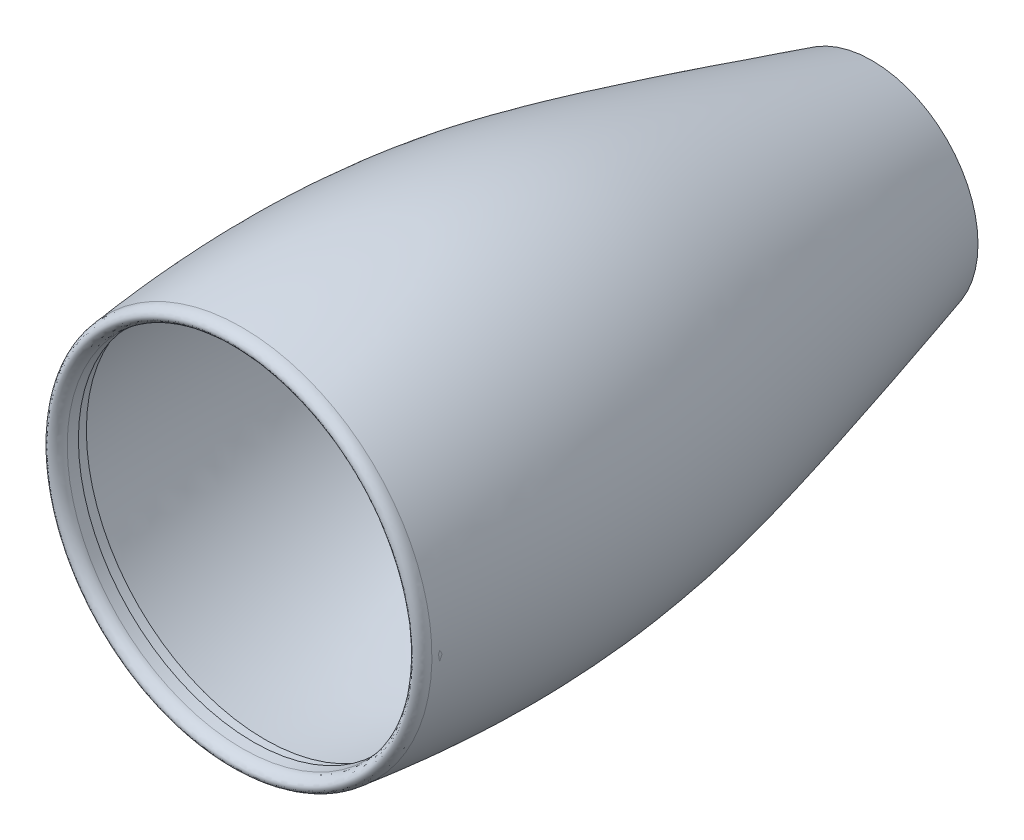
ISO-10303-21;
HEADER;
FILE_DESCRIPTION(('STEP AP214'),'2;1');
FILE_NAME('part.step','',(''),(''),'','','');
FILE_SCHEMA(('AUTOMOTIVE_DESIGN { 1 0 10303 214 1 1 1 1 }'));
ENDSEC;
DATA;
#1=APPLICATION_CONTEXT('core data for automotive mechanical design processes');
#2=APPLICATION_PROTOCOL_DEFINITION('international standard','automotive_design',2000,#1);
#3=PRODUCT_CONTEXT('',#1,'mechanical');
#4=PRODUCT('Part','Part','',(#3));
#5=PRODUCT_RELATED_PRODUCT_CATEGORY('part','',(#4));
#6=PRODUCT_DEFINITION_FORMATION('','',#4);
#7=PRODUCT_DEFINITION_CONTEXT('part definition',#1,'design');
#8=PRODUCT_DEFINITION('design','',#6,#7);
#9=PRODUCT_DEFINITION_SHAPE('','',#8);
#10=(LENGTH_UNIT() NAMED_UNIT(*) SI_UNIT(.MILLI.,.METRE.));
#11=(NAMED_UNIT(*) PLANE_ANGLE_UNIT() SI_UNIT($,.RADIAN.));
#12=(NAMED_UNIT(*) SI_UNIT($,.STERADIAN.) SOLID_ANGLE_UNIT());
#13=UNCERTAINTY_MEASURE_WITH_UNIT(LENGTH_MEASURE(1.E-05),#10,'distance_accuracy_value','');
#14=(GEOMETRIC_REPRESENTATION_CONTEXT(3) GLOBAL_UNCERTAINTY_ASSIGNED_CONTEXT((#13)) GLOBAL_UNIT_ASSIGNED_CONTEXT((#10,
#11,#12)) REPRESENTATION_CONTEXT('',''));
#15=CARTESIAN_POINT('',(0.,0.,0.));
#16=DIRECTION('',(0.,0.,1.));
#17=DIRECTION('',(1.,0.,0.));
#18=AXIS2_PLACEMENT_3D('',#15,#16,#17);
#19=CARTESIAN_POINT('',(0.,0.,-403.00562877427));
#20=DIRECTION('',(0.,0.,1.));
#21=DIRECTION('',(1.,0.,0.));
#22=AXIS2_PLACEMENT_3D('',#19,#20,#21);
#23=PLANE('',#22);
#24=CARTESIAN_POINT('',(0.,0.,-403.00562877427));
#25=DIRECTION('',(0.,0.,-1.));
#26=DIRECTION('',(-1.,0.,0.));
#27=AXIS2_PLACEMENT_3D('',#24,#25,#26);
#28=CIRCLE('',#27,3400.75582565315);
#29=CARTESIAN_POINT('',(-3400.75582565315,0.,-403.00562877427));
#30=VERTEX_POINT('',#29);
#31=EDGE_CURVE('E51',#30,#30,#28,.T.);
#32=ORIENTED_EDGE('',*,*,#31,.F.);
#33=EDGE_LOOP('',(#32));
#34=FACE_BOUND('',#33,.T.);
#35=CARTESIAN_POINT('',(0.,0.,-403.00562877427));
#36=DIRECTION('',(0.,0.,-1.));
#37=DIRECTION('',(-1.,0.,0.));
#38=AXIS2_PLACEMENT_3D('',#35,#36,#37);
#39=CIRCLE('',#38,3420.75582565315);
#40=CARTESIAN_POINT('',(-3420.75582565315,0.,-403.00562877427));
#41=VERTEX_POINT('',#40);
#42=EDGE_CURVE('E128',#41,#41,#39,.T.);
#43=ORIENTED_EDGE('',*,*,#42,.T.);
#44=EDGE_LOOP('',(#43));
#45=FACE_BOUND('',#44,.T.);
#46=ADVANCED_FACE('F33',(#34,#45),#23,.F.);
#47=CARTESIAN_POINT('',(0.,0.,-11968.002568167));
#48=DIRECTION('',(0.,0.,-1.));
#49=DIRECTION('',(-1.,0.,0.));
#50=AXIS2_PLACEMENT_3D('',#47,#48,#49);
#51=CONICAL_SURFACE('',#50,1999.99999999998,1.29066201510487);
#52=CARTESIAN_POINT('',(0.,0.,-11973.532262708));
#53=DIRECTION('',(0.,0.,-1.));
#54=DIRECTION('',(0.,1.,0.));
#55=AXIS2_PLACEMENT_3D('',#52,#53,#54);
#56=CIRCLE('',#55,2019.22036623695);
#57=CARTESIAN_POINT('',(0.,2019.22036623695,-11973.532262708));
#58=VERTEX_POINT('',#57);
#59=EDGE_CURVE('E10',#58,#58,#56,.T.);
#60=ORIENTED_EDGE('',*,*,#59,.T.);
#61=EDGE_LOOP('',(#60));
#62=FACE_BOUND('',#61,.T.);
#63=CARTESIAN_POINT('',(0.,0.,-11968.002568167));
#64=DIRECTION('',(0.,0.,-1.));
#65=DIRECTION('',(-1.,0.,0.));
#66=AXIS2_PLACEMENT_3D('',#63,#64,#65);
#67=CIRCLE('',#66,1999.99999999998);
#68=CARTESIAN_POINT('',(-1999.99999999998,0.,-11968.002568167));
#69=VERTEX_POINT('',#68);
#70=EDGE_CURVE('E117',#69,#69,#67,.T.);
#71=ORIENTED_EDGE('',*,*,#70,.F.);
#72=EDGE_LOOP('',(#71));
#73=FACE_BOUND('',#72,.T.);
#74=ADVANCED_FACE('F106',(#62,#73),#51,.F.);
#75=CARTESIAN_POINT('',(0.,1999.99999999998,-11968.002568167));
#76=CARTESIAN_POINT('',(0.,3133.44661629204,-8028.3167657127));
#77=CARTESIAN_POINT('',(0.,4004.90279590617,-4100.24518060058));
#78=CARTESIAN_POINT('',(0.,3729.63500147312,-1119.5796251517));
#79=CARTESIAN_POINT('',(0.,3600.,31.9974318330272));
#80=B_SPLINE_CURVE_WITH_KNOTS('',3,(#75,#76,#77,#78,#79),.UNSPECIFIED.,.F.,.F.,(4,1,4),(0.,
0.365657833485736,1.),.UNSPECIFIED.);
#81=CARTESIAN_POINT('',(0.,0.,31.9974318330265));
#82=DIRECTION('',(0.,0.,-1.));
#83=AXIS1_PLACEMENT('',#81,#82);
#84=SURFACE_OF_REVOLUTION('',#80,#83);
#85=OFFSET_SURFACE('',#84,-20.,.F.);
#86=CARTESIAN_POINT('',(0.,0.,33.023224622575));
#87=DIRECTION('',(0.,0.,-1.));
#88=DIRECTION('',(-1.,0.,0.));
#89=AXIS2_PLACEMENT_3D('',#86,#87,#88);
#90=CIRCLE('',#89,3620.01083559025);
#91=CARTESIAN_POINT('',(-3620.01083559025,0.,33.023224622575));
#92=VERTEX_POINT('',#91);
#93=EDGE_CURVE('E40',#92,#92,#90,.T.);
#94=ORIENTED_EDGE('',*,*,#93,.T.);
#95=EDGE_LOOP('',(#94));
#96=FACE_BOUND('',#95,.T.);
#97=ORIENTED_EDGE('',*,*,#59,.F.);
#98=EDGE_LOOP('',(#97));
#99=FACE_BOUND('',#98,.T.);
#100=ADVANCED_FACE('F75',(#96,#99),#85,.F.);
#101=CARTESIAN_POINT('',(0.,3600.,31.9974318330272));
#102=CARTESIAN_POINT('',(0.,3601.34943217367,151.698806620411));
#103=CARTESIAN_POINT('',(0.,3531.84114456241,222.223732303106));
#104=CARTESIAN_POINT('',(0.,3432.23330440368,229.941617766769));
#105=CARTESIAN_POINT('',(0.,3350.,127.383166162419));
#106=CARTESIAN_POINT('',(0.,3350.,31.9974318330269));
#107=B_SPLINE_CURVE_WITH_KNOTS('',3,(#101,#102,#103,#104,#105,#106),.UNSPECIFIED.,.F.,.F.,(4,1,
1,4),(0.,0.458926866209816,0.558926866209816,1.),.UNSPECIFIED.);
#108=CARTESIAN_POINT('',(0.,0.,31.9974318330265));
#109=DIRECTION('',(0.,0.,-1.));
#110=AXIS1_PLACEMENT('',#108,#109);
#111=SURFACE_OF_REVOLUTION('',#107,#110);
#112=OFFSET_SURFACE('',#111,-20.,.F.);
#113=CARTESIAN_POINT('',(0.,0.,31.9974318330268));
#114=DIRECTION('',(0.,0.,-1.));
#115=DIRECTION('',(0.,1.,0.));
#116=AXIS2_PLACEMENT_3D('',#113,#114,#115);
#117=CIRCLE('',#116,3330.);
#118=CARTESIAN_POINT('',(0.,3330.,31.9974318330268));
#119=VERTEX_POINT('',#118);
#120=EDGE_CURVE('E45',#119,#119,#117,.T.);
#121=ORIENTED_EDGE('',*,*,#120,.T.);
#122=EDGE_LOOP('',(#121));
#123=FACE_BOUND('',#122,.T.);
#124=ORIENTED_EDGE('',*,*,#93,.F.);
#125=EDGE_LOOP('',(#124));
#126=FACE_BOUND('',#125,.T.);
#127=ADVANCED_FACE('F76',(#123,#126),#112,.F.);
#128=CARTESIAN_POINT('',(0.,0.,31.9974318330265));
#129=DIRECTION('',(0.,0.,-1.));
#130=DIRECTION('',(-1.,0.,0.));
#131=AXIS2_PLACEMENT_3D('',#128,#129,#130);
#132=CYLINDRICAL_SURFACE('',#131,3330.);
#133=CARTESIAN_POINT('',(0.,0.,-180.42202054829));
#134=DIRECTION('',(0.,0.,-1.));
#135=DIRECTION('',(-1.,0.,0.));
#136=AXIS2_PLACEMENT_3D('',#133,#134,#135);
#137=CIRCLE('',#136,3330.);
#138=CARTESIAN_POINT('',(-3330.,0.,-180.42202054829));
#139=VERTEX_POINT('',#138);
#140=EDGE_CURVE('E54',#139,#139,#137,.T.);
#141=ORIENTED_EDGE('',*,*,#140,.T.);
#142=EDGE_LOOP('',(#141));
#143=FACE_BOUND('',#142,.T.);
#144=ORIENTED_EDGE('',*,*,#120,.F.);
#145=EDGE_LOOP('',(#144));
#146=FACE_BOUND('',#145,.T.);
#147=ADVANCED_FACE('F79',(#143,#146),#132,.F.);
#148=CARTESIAN_POINT('',(0.,0.,-185.928938975459));
#149=DIRECTION('',(0.,0.,-1.));
#150=DIRECTION('',(-1.,0.,0.));
#151=AXIS2_PLACEMENT_3D('',#148,#149,#150);
#152=CONICAL_SURFACE('',#151,3341.13178543129,1.11139595544609);
#153=CARTESIAN_POINT('',(0.,0.,-215.425081155587));
#154=DIRECTION('',(0.,0.,-1.));
#155=DIRECTION('',(-1.,0.,0.));
#156=AXIS2_PLACEMENT_3D('',#153,#154,#155);
#157=CIRCLE('',#156,3400.75582565315);
#158=CARTESIAN_POINT('',(-3400.75582565315,0.,-215.425081155587));
#159=VERTEX_POINT('',#158);
#160=EDGE_CURVE('E49',#159,#159,#157,.T.);
#161=ORIENTED_EDGE('',*,*,#160,.T.);
#162=EDGE_LOOP('',(#161));
#163=FACE_BOUND('',#162,.T.);
#164=ORIENTED_EDGE('',*,*,#140,.F.);
#165=EDGE_LOOP('',(#164));
#166=FACE_BOUND('',#165,.T.);
#167=ADVANCED_FACE('F88',(#163,#166),#152,.F.);
#168=CARTESIAN_POINT('',(0.,0.,31.9974318330265));
#169=DIRECTION('',(0.,0.,-1.));
#170=DIRECTION('',(-1.,0.,0.));
#171=AXIS2_PLACEMENT_3D('',#168,#169,#170);
#172=CYLINDRICAL_SURFACE('',#171,3400.75582565315);
#173=ORIENTED_EDGE('',*,*,#31,.T.);
#174=EDGE_LOOP('',(#173));
#175=FACE_BOUND('',#174,.T.);
#176=ORIENTED_EDGE('',*,*,#160,.F.);
#177=EDGE_LOOP('',(#176));
#178=FACE_BOUND('',#177,.T.);
#179=ADVANCED_FACE('F73',(#175,#178),#172,.F.);
#180=CARTESIAN_POINT('',(0.,1999.99999999998,-11968.002568167));
#181=CARTESIAN_POINT('',(0.,3133.44661629204,-8028.3167657127));
#182=CARTESIAN_POINT('',(0.,4004.90279590617,-4100.24518060058));
#183=CARTESIAN_POINT('',(0.,3729.63500147312,-1119.5796251517));
#184=CARTESIAN_POINT('',(0.,3600.,31.9974318330272));
#185=B_SPLINE_CURVE_WITH_KNOTS('',3,(#180,#181,#182,#183,#184),.UNSPECIFIED.,.F.,.F.,(4,1,4),
(0.,0.365657833485736,1.),.UNSPECIFIED.);
#186=CARTESIAN_POINT('',(0.,0.,31.9974318330265));
#187=DIRECTION('',(0.,0.,-1.));
#188=AXIS1_PLACEMENT('',#186,#187);
#189=SURFACE_OF_REVOLUTION('',#185,#188);
#190=CARTESIAN_POINT('',(0.,0.,31.9974318330272));
#191=DIRECTION('',(0.,0.,-1.));
#192=DIRECTION('',(-1.,0.,0.));
#193=AXIS2_PLACEMENT_3D('',#190,#191,#192);
#194=CIRCLE('',#193,3600.);
#195=CARTESIAN_POINT('',(-3600.,0.,31.9974318330272));
#196=VERTEX_POINT('',#195);
#197=EDGE_CURVE('E36',#196,#196,#194,.T.);
#198=ORIENTED_EDGE('',*,*,#197,.F.);
#199=EDGE_LOOP('',(#198));
#200=FACE_BOUND('',#199,.T.);
#201=ORIENTED_EDGE('',*,*,#70,.T.);
#202=EDGE_LOOP('',(#201));
#203=FACE_BOUND('',#202,.T.);
#204=ADVANCED_FACE('F67',(#200,#203),#189,.T.);
#205=CARTESIAN_POINT('',(0.,3600.,31.9974318330272));
#206=CARTESIAN_POINT('',(0.,3601.34943217367,151.698806620411));
#207=CARTESIAN_POINT('',(0.,3531.84114456241,222.223732303106));
#208=CARTESIAN_POINT('',(0.,3432.23330440368,229.941617766769));
#209=CARTESIAN_POINT('',(0.,3350.,127.383166162419));
#210=CARTESIAN_POINT('',(0.,3350.,31.9974318330269));
#211=B_SPLINE_CURVE_WITH_KNOTS('',3,(#205,#206,#207,#208,#209,#210),.UNSPECIFIED.,.F.,.F.,(4,1,
1,4),(0.,0.458926866209816,0.558926866209816,1.),.UNSPECIFIED.);
#212=CARTESIAN_POINT('',(0.,0.,31.9974318330265));
#213=DIRECTION('',(0.,0.,-1.));
#214=AXIS1_PLACEMENT('',#212,#213);
#215=SURFACE_OF_REVOLUTION('',#211,#214);
#216=CARTESIAN_POINT('',(0.,0.,31.9974318330269));
#217=DIRECTION('',(0.,0.,-1.));
#218=DIRECTION('',(-1.,0.,0.));
#219=AXIS2_PLACEMENT_3D('',#216,#217,#218);
#220=CIRCLE('',#219,3350.);
#221=CARTESIAN_POINT('',(-3350.,0.,31.9974318330269));
#222=VERTEX_POINT('',#221);
#223=EDGE_CURVE('E121',#222,#222,#220,.T.);
#224=ORIENTED_EDGE('',*,*,#223,.F.);
#225=EDGE_LOOP('',(#224));
#226=FACE_BOUND('',#225,.T.);
#227=ORIENTED_EDGE('',*,*,#197,.T.);
#228=EDGE_LOOP('',(#227));
#229=FACE_BOUND('',#228,.T.);
#230=ADVANCED_FACE('F72',(#226,#229),#215,.T.);
#231=CARTESIAN_POINT('',(0.,0.,31.9974318330265));
#232=DIRECTION('',(0.,0.,-1.));
#233=DIRECTION('',(-1.,0.,0.));
#234=AXIS2_PLACEMENT_3D('',#231,#232,#233);
#235=CYLINDRICAL_SURFACE('',#234,3350.);
#236=CARTESIAN_POINT('',(0.,0.,-168.002568166973));
#237=DIRECTION('',(0.,0.,-1.));
#238=DIRECTION('',(-1.,0.,0.));
#239=AXIS2_PLACEMENT_3D('',#236,#237,#238);
#240=CIRCLE('',#239,3350.);
#241=CARTESIAN_POINT('',(-3350.,0.,-168.002568166973));
#242=VERTEX_POINT('',#241);
#243=EDGE_CURVE('E125',#242,#242,#240,.T.);
#244=ORIENTED_EDGE('',*,*,#243,.F.);
#245=EDGE_LOOP('',(#244));
#246=FACE_BOUND('',#245,.T.);
#247=ORIENTED_EDGE('',*,*,#223,.T.);
#248=EDGE_LOOP('',(#247));
#249=FACE_BOUND('',#248,.T.);
#250=ADVANCED_FACE('F84',(#246,#249),#235,.T.);
#251=CARTESIAN_POINT('',(0.,0.,-168.002568166973));
#252=DIRECTION('',(0.,0.,-1.));
#253=DIRECTION('',(-1.,0.,0.));
#254=AXIS2_PLACEMENT_3D('',#251,#252,#253);
#255=CONICAL_SURFACE('',#254,3350.,1.11139595544609);
#256=CARTESIAN_POINT('',(0.,0.,-203.00562877427));
#257=DIRECTION('',(0.,0.,-1.));
#258=DIRECTION('',(-1.,0.,0.));
#259=AXIS2_PLACEMENT_3D('',#256,#257,#258);
#260=CIRCLE('',#259,3420.75582565315);
#261=CARTESIAN_POINT('',(-3420.75582565315,0.,-203.00562877427));
#262=VERTEX_POINT('',#261);
#263=EDGE_CURVE('E129',#262,#262,#260,.T.);
#264=ORIENTED_EDGE('',*,*,#263,.F.);
#265=EDGE_LOOP('',(#264));
#266=FACE_BOUND('',#265,.T.);
#267=ORIENTED_EDGE('',*,*,#243,.T.);
#268=EDGE_LOOP('',(#267));
#269=FACE_BOUND('',#268,.T.);
#270=ADVANCED_FACE('F99',(#266,#269),#255,.T.);
#271=CARTESIAN_POINT('',(0.,0.,31.9974318330265));
#272=DIRECTION('',(0.,0.,-1.));
#273=DIRECTION('',(-1.,0.,0.));
#274=AXIS2_PLACEMENT_3D('',#271,#272,#273);
#275=CYLINDRICAL_SURFACE('',#274,3420.75582565315);
#276=ORIENTED_EDGE('',*,*,#42,.F.);
#277=EDGE_LOOP('',(#276));
#278=FACE_BOUND('',#277,.T.);
#279=ORIENTED_EDGE('',*,*,#263,.T.);
#280=EDGE_LOOP('',(#279));
#281=FACE_BOUND('',#280,.T.);
#282=ADVANCED_FACE('F96',(#278,#281),#275,.T.);
#283=CLOSED_SHELL('',(#46,#74,#100,#127,#147,#167,#179,#204,#230,#250,#270,#282));
#284=MANIFOLD_SOLID_BREP('B2',#283);
#285=ADVANCED_BREP_SHAPE_REPRESENTATION('',(#18,#284),#14);
#286=SHAPE_DEFINITION_REPRESENTATION(#9,#285);
ENDSEC;
END-ISO-10303-21;
